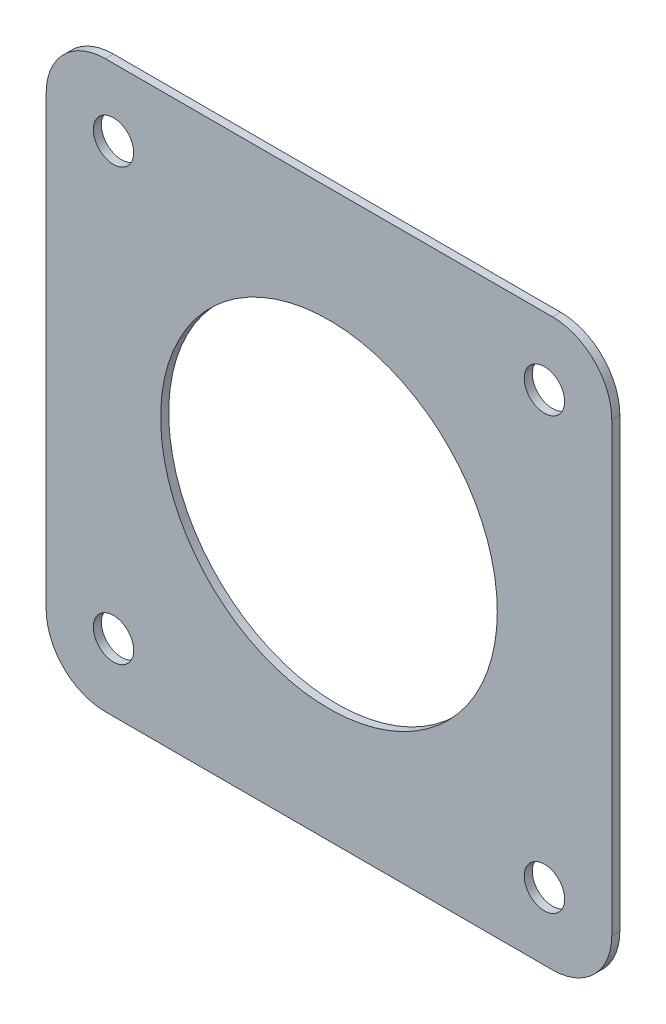
ISO-10303-21;
HEADER;
FILE_DESCRIPTION(('STEP AP214'),'2;1');
FILE_NAME('part.step','',(''),(''),'','','');
FILE_SCHEMA(('AUTOMOTIVE_DESIGN { 1 0 10303 214 1 1 1 1 }'));
ENDSEC;
DATA;
#1=APPLICATION_CONTEXT('core data for automotive mechanical design processes');
#2=APPLICATION_PROTOCOL_DEFINITION('international standard','automotive_design',2000,#1);
#3=PRODUCT_CONTEXT('',#1,'mechanical');
#4=PRODUCT('Part','Part','',(#3));
#5=PRODUCT_RELATED_PRODUCT_CATEGORY('part','',(#4));
#6=PRODUCT_DEFINITION_FORMATION('','',#4);
#7=PRODUCT_DEFINITION_CONTEXT('part definition',#1,'design');
#8=PRODUCT_DEFINITION('design','',#6,#7);
#9=PRODUCT_DEFINITION_SHAPE('','',#8);
#10=(LENGTH_UNIT() NAMED_UNIT(*) SI_UNIT(.MILLI.,.METRE.));
#11=(NAMED_UNIT(*) PLANE_ANGLE_UNIT() SI_UNIT($,.RADIAN.));
#12=(NAMED_UNIT(*) SI_UNIT($,.STERADIAN.) SOLID_ANGLE_UNIT());
#13=UNCERTAINTY_MEASURE_WITH_UNIT(LENGTH_MEASURE(1.E-05),#10,'distance_accuracy_value','');
#14=(GEOMETRIC_REPRESENTATION_CONTEXT(3) GLOBAL_UNCERTAINTY_ASSIGNED_CONTEXT((#13)) GLOBAL_UNIT_ASSIGNED_CONTEXT((#10,
#11,#12)) REPRESENTATION_CONTEXT('',''));
#15=CARTESIAN_POINT('',(0.,0.,0.));
#16=DIRECTION('',(0.,0.,1.));
#17=DIRECTION('',(1.,0.,0.));
#18=AXIS2_PLACEMENT_3D('',#15,#16,#17);
#19=CARTESIAN_POINT('',(-83.,-82.9999999999994,3.));
#20=DIRECTION('',(0.,0.,1.));
#21=DIRECTION('',(1.,0.,0.));
#22=AXIS2_PLACEMENT_3D('',#19,#20,#21);
#23=PLANE('',#22);
#24=CARTESIAN_POINT('',(-80.,-79.9999999999994,3.));
#25=DIRECTION('',(0.,0.,1.));
#26=DIRECTION('',(1.,0.,0.));
#27=AXIS2_PLACEMENT_3D('',#24,#25,#26);
#28=CIRCLE('',#27,7.5);
#29=CARTESIAN_POINT('',(-72.5,-79.9999999999994,3.));
#30=VERTEX_POINT('',#29);
#31=EDGE_CURVE('E194',#30,#30,#28,.T.);
#32=ORIENTED_EDGE('',*,*,#31,.F.);
#33=EDGE_LOOP('',(#32));
#34=FACE_BOUND('',#33,.T.);
#35=CARTESIAN_POINT('',(80.,80.,3.));
#36=DIRECTION('',(0.,0.,1.));
#37=DIRECTION('',(1.,0.,0.));
#38=AXIS2_PLACEMENT_3D('',#35,#36,#37);
#39=CIRCLE('',#38,7.5);
#40=CARTESIAN_POINT('',(87.5,80.,3.));
#41=VERTEX_POINT('',#40);
#42=EDGE_CURVE('E182',#41,#41,#39,.T.);
#43=ORIENTED_EDGE('',*,*,#42,.F.);
#44=EDGE_LOOP('',(#43));
#45=FACE_BOUND('',#44,.T.);
#46=CARTESIAN_POINT('',(-83.,-82.9999999999994,3.));
#47=DIRECTION('',(0.,0.,1.));
#48=DIRECTION('',(1.,0.,0.));
#49=AXIS2_PLACEMENT_3D('',#46,#47,#48);
#50=CIRCLE('',#49,22.);
#51=CARTESIAN_POINT('',(-105.,-82.9999999999994,3.));
#52=VERTEX_POINT('',#51);
#53=CARTESIAN_POINT('',(-82.9999999999999,-104.999999999999,3.));
#54=VERTEX_POINT('',#53);
#55=EDGE_CURVE('E145',#52,#54,#50,.T.);
#56=ORIENTED_EDGE('',*,*,#55,.T.);
#57=DIRECTION('',(1.,0.,0.));
#58=VECTOR('',#57,1.);
#59=CARTESIAN_POINT('',(-82.9999999999999,-104.999999999999,3.));
#60=LINE('',#59,#58);
#61=CARTESIAN_POINT('',(83.0000000000001,-105.,3.));
#62=VERTEX_POINT('',#61);
#63=EDGE_CURVE('E93',#54,#62,#60,.T.);
#64=ORIENTED_EDGE('',*,*,#63,.T.);
#65=CARTESIAN_POINT('',(83.,-83.,3.));
#66=DIRECTION('',(0.,0.,1.));
#67=DIRECTION('',(1.,0.,0.));
#68=AXIS2_PLACEMENT_3D('',#65,#66,#67);
#69=CIRCLE('',#68,22.);
#70=CARTESIAN_POINT('',(105.,-82.9999999999994,3.));
#71=VERTEX_POINT('',#70);
#72=EDGE_CURVE('E160',#62,#71,#69,.T.);
#73=ORIENTED_EDGE('',*,*,#72,.T.);
#74=DIRECTION('',(0.,1.,0.));
#75=VECTOR('',#74,1.);
#76=CARTESIAN_POINT('',(105.,-82.9999999999994,3.));
#77=LINE('',#76,#75);
#78=CARTESIAN_POINT('',(105.,83.0000000000006,3.));
#79=VERTEX_POINT('',#78);
#80=EDGE_CURVE('E173',#71,#79,#77,.T.);
#81=ORIENTED_EDGE('',*,*,#80,.T.);
#82=CARTESIAN_POINT('',(83.0000000000001,83.,3.));
#83=DIRECTION('',(0.,0.,1.));
#84=DIRECTION('',(1.,0.,0.));
#85=AXIS2_PLACEMENT_3D('',#82,#83,#84);
#86=CIRCLE('',#85,22.);
#87=CARTESIAN_POINT('',(83.,105.,3.));
#88=VERTEX_POINT('',#87);
#89=EDGE_CURVE('E112',#79,#88,#86,.T.);
#90=ORIENTED_EDGE('',*,*,#89,.T.);
#91=DIRECTION('',(-1.,0.,0.));
#92=VECTOR('',#91,1.);
#93=CARTESIAN_POINT('',(83.,105.,3.));
#94=LINE('',#93,#92);
#95=CARTESIAN_POINT('',(-83.,105.000000000001,3.));
#96=VERTEX_POINT('',#95);
#97=EDGE_CURVE('E106',#88,#96,#94,.T.);
#98=ORIENTED_EDGE('',*,*,#97,.T.);
#99=CARTESIAN_POINT('',(-82.9999999999999,83.0000000000006,3.));
#100=DIRECTION('',(0.,0.,1.));
#101=DIRECTION('',(1.,0.,0.));
#102=AXIS2_PLACEMENT_3D('',#99,#100,#101);
#103=CIRCLE('',#102,22.);
#104=CARTESIAN_POINT('',(-105.,83.0000000000006,3.));
#105=VERTEX_POINT('',#104);
#106=EDGE_CURVE('E110',#96,#105,#103,.T.);
#107=ORIENTED_EDGE('',*,*,#106,.T.);
#108=DIRECTION('',(0.,-1.,0.));
#109=VECTOR('',#108,1.);
#110=CARTESIAN_POINT('',(-105.,83.0000000000006,3.));
#111=LINE('',#110,#109);
#112=EDGE_CURVE('E50',#105,#52,#111,.T.);
#113=ORIENTED_EDGE('',*,*,#112,.T.);
#114=EDGE_LOOP('',(#56,#64,#73,#81,#90,#98,#107,#113));
#115=FACE_BOUND('',#114,.T.);
#116=CARTESIAN_POINT('',(-79.9999999999992,80.0000000000015,3.));
#117=DIRECTION('',(0.,0.,1.));
#118=DIRECTION('',(1.,0.,0.));
#119=AXIS2_PLACEMENT_3D('',#116,#117,#118);
#120=CIRCLE('',#119,7.5);
#121=CARTESIAN_POINT('',(-72.4999999999992,80.0000000000015,3.));
#122=VERTEX_POINT('',#121);
#123=EDGE_CURVE('E134',#122,#122,#120,.T.);
#124=ORIENTED_EDGE('',*,*,#123,.F.);
#125=EDGE_LOOP('',(#124));
#126=FACE_BOUND('',#125,.T.);
#127=CARTESIAN_POINT('',(79.9999999999997,-80.0000000000003,3.));
#128=DIRECTION('',(0.,0.,1.));
#129=DIRECTION('',(1.,0.,0.));
#130=AXIS2_PLACEMENT_3D('',#127,#128,#129);
#131=CIRCLE('',#130,7.5);
#132=CARTESIAN_POINT('',(87.4999999999997,-80.0000000000003,3.));
#133=VERTEX_POINT('',#132);
#134=EDGE_CURVE('E188',#133,#133,#131,.T.);
#135=ORIENTED_EDGE('',*,*,#134,.F.);
#136=EDGE_LOOP('',(#135));
#137=FACE_BOUND('',#136,.T.);
#138=CARTESIAN_POINT('',(0.,0.,3.));
#139=DIRECTION('',(0.,0.,1.));
#140=DIRECTION('',(1.,0.,0.));
#141=AXIS2_PLACEMENT_3D('',#138,#139,#140);
#142=CIRCLE('',#141,62.5);
#143=CARTESIAN_POINT('',(62.5,0.,3.));
#144=VERTEX_POINT('',#143);
#145=EDGE_CURVE('E200',#144,#144,#142,.T.);
#146=ORIENTED_EDGE('',*,*,#145,.F.);
#147=EDGE_LOOP('',(#146));
#148=FACE_BOUND('',#147,.T.);
#149=ADVANCED_FACE('F33',(#34,#45,#115,#126,#137,#148),#23,.T.);
#150=CARTESIAN_POINT('',(-83.,-82.9999999999994,0.));
#151=DIRECTION('',(0.,0.,1.));
#152=DIRECTION('',(1.,0.,0.));
#153=AXIS2_PLACEMENT_3D('',#150,#151,#152);
#154=PLANE('',#153);
#155=CARTESIAN_POINT('',(-80.,-79.9999999999994,0.));
#156=DIRECTION('',(0.,0.,1.));
#157=DIRECTION('',(1.,0.,0.));
#158=AXIS2_PLACEMENT_3D('',#155,#156,#157);
#159=CIRCLE('',#158,7.5);
#160=CARTESIAN_POINT('',(-72.5,-79.9999999999994,0.));
#161=VERTEX_POINT('',#160);
#162=EDGE_CURVE('E197',#161,#161,#159,.T.);
#163=ORIENTED_EDGE('',*,*,#162,.T.);
#164=EDGE_LOOP('',(#163));
#165=FACE_BOUND('',#164,.T.);
#166=CARTESIAN_POINT('',(80.,80.,0.));
#167=DIRECTION('',(0.,0.,1.));
#168=DIRECTION('',(1.,0.,0.));
#169=AXIS2_PLACEMENT_3D('',#166,#167,#168);
#170=CIRCLE('',#169,7.5);
#171=CARTESIAN_POINT('',(87.5,80.,0.));
#172=VERTEX_POINT('',#171);
#173=EDGE_CURVE('E185',#172,#172,#170,.T.);
#174=ORIENTED_EDGE('',*,*,#173,.T.);
#175=EDGE_LOOP('',(#174));
#176=FACE_BOUND('',#175,.T.);
#177=CARTESIAN_POINT('',(-83.,-82.9999999999994,0.));
#178=DIRECTION('',(0.,0.,1.));
#179=DIRECTION('',(1.,0.,0.));
#180=AXIS2_PLACEMENT_3D('',#177,#178,#179);
#181=CIRCLE('',#180,22.);
#182=CARTESIAN_POINT('',(-105.,-82.9999999999994,0.));
#183=VERTEX_POINT('',#182);
#184=CARTESIAN_POINT('',(-82.9999999999999,-104.999999999999,0.));
#185=VERTEX_POINT('',#184);
#186=EDGE_CURVE('E130',#183,#185,#181,.T.);
#187=ORIENTED_EDGE('',*,*,#186,.F.);
#188=DIRECTION('',(0.,-1.,0.));
#189=VECTOR('',#188,1.);
#190=CARTESIAN_POINT('',(-105.,83.0000000000006,0.));
#191=LINE('',#190,#189);
#192=CARTESIAN_POINT('',(-105.,83.0000000000006,0.));
#193=VERTEX_POINT('',#192);
#194=EDGE_CURVE('E85',#193,#183,#191,.T.);
#195=ORIENTED_EDGE('',*,*,#194,.F.);
#196=CARTESIAN_POINT('',(-82.9999999999999,83.0000000000006,0.));
#197=DIRECTION('',(0.,0.,1.));
#198=DIRECTION('',(1.,0.,0.));
#199=AXIS2_PLACEMENT_3D('',#196,#197,#198);
#200=CIRCLE('',#199,22.);
#201=CARTESIAN_POINT('',(-83.,105.000000000001,0.));
#202=VERTEX_POINT('',#201);
#203=EDGE_CURVE('E79',#202,#193,#200,.T.);
#204=ORIENTED_EDGE('',*,*,#203,.F.);
#205=DIRECTION('',(-1.,0.,0.));
#206=VECTOR('',#205,1.);
#207=CARTESIAN_POINT('',(83.,105.,0.));
#208=LINE('',#207,#206);
#209=CARTESIAN_POINT('',(83.,105.,0.));
#210=VERTEX_POINT('',#209);
#211=EDGE_CURVE('E120',#210,#202,#208,.T.);
#212=ORIENTED_EDGE('',*,*,#211,.F.);
#213=CARTESIAN_POINT('',(83.0000000000001,83.,0.));
#214=DIRECTION('',(0.,0.,1.));
#215=DIRECTION('',(1.,0.,0.));
#216=AXIS2_PLACEMENT_3D('',#213,#214,#215);
#217=CIRCLE('',#216,22.);
#218=CARTESIAN_POINT('',(105.,83.0000000000006,0.));
#219=VERTEX_POINT('',#218);
#220=EDGE_CURVE('E140',#219,#210,#217,.T.);
#221=ORIENTED_EDGE('',*,*,#220,.F.);
#222=DIRECTION('',(0.,1.,0.));
#223=VECTOR('',#222,1.);
#224=CARTESIAN_POINT('',(105.,-82.9999999999994,0.));
#225=LINE('',#224,#223);
#226=CARTESIAN_POINT('',(105.,-82.9999999999994,0.));
#227=VERTEX_POINT('',#226);
#228=EDGE_CURVE('E138',#227,#219,#225,.T.);
#229=ORIENTED_EDGE('',*,*,#228,.F.);
#230=CARTESIAN_POINT('',(83.,-83.,0.));
#231=DIRECTION('',(0.,0.,1.));
#232=DIRECTION('',(1.,0.,0.));
#233=AXIS2_PLACEMENT_3D('',#230,#231,#232);
#234=CIRCLE('',#233,22.);
#235=CARTESIAN_POINT('',(83.0000000000001,-105.,0.));
#236=VERTEX_POINT('',#235);
#237=EDGE_CURVE('E136',#236,#227,#234,.T.);
#238=ORIENTED_EDGE('',*,*,#237,.F.);
#239=DIRECTION('',(1.,0.,0.));
#240=VECTOR('',#239,1.);
#241=CARTESIAN_POINT('',(-82.9999999999999,-104.999999999999,0.));
#242=LINE('',#241,#240);
#243=EDGE_CURVE('E133',#185,#236,#242,.T.);
#244=ORIENTED_EDGE('',*,*,#243,.F.);
#245=EDGE_LOOP('',(#187,#195,#204,#212,#221,#229,#238,#244));
#246=FACE_BOUND('',#245,.T.);
#247=CARTESIAN_POINT('',(-79.9999999999992,80.0000000000015,0.));
#248=DIRECTION('',(0.,0.,1.));
#249=DIRECTION('',(1.,0.,0.));
#250=AXIS2_PLACEMENT_3D('',#247,#248,#249);
#251=CIRCLE('',#250,7.5);
#252=CARTESIAN_POINT('',(-72.4999999999992,80.0000000000015,0.));
#253=VERTEX_POINT('',#252);
#254=EDGE_CURVE('E179',#253,#253,#251,.T.);
#255=ORIENTED_EDGE('',*,*,#254,.T.);
#256=EDGE_LOOP('',(#255));
#257=FACE_BOUND('',#256,.T.);
#258=CARTESIAN_POINT('',(79.9999999999997,-80.0000000000003,0.));
#259=DIRECTION('',(0.,0.,1.));
#260=DIRECTION('',(1.,0.,0.));
#261=AXIS2_PLACEMENT_3D('',#258,#259,#260);
#262=CIRCLE('',#261,7.5);
#263=CARTESIAN_POINT('',(87.4999999999997,-80.0000000000003,0.));
#264=VERTEX_POINT('',#263);
#265=EDGE_CURVE('E191',#264,#264,#262,.T.);
#266=ORIENTED_EDGE('',*,*,#265,.T.);
#267=EDGE_LOOP('',(#266));
#268=FACE_BOUND('',#267,.T.);
#269=CARTESIAN_POINT('',(0.,0.,0.));
#270=DIRECTION('',(0.,0.,1.));
#271=DIRECTION('',(1.,0.,0.));
#272=AXIS2_PLACEMENT_3D('',#269,#270,#271);
#273=CIRCLE('',#272,62.5);
#274=CARTESIAN_POINT('',(62.5,0.,0.));
#275=VERTEX_POINT('',#274);
#276=EDGE_CURVE('E203',#275,#275,#273,.T.);
#277=ORIENTED_EDGE('',*,*,#276,.T.);
#278=EDGE_LOOP('',(#277));
#279=FACE_BOUND('',#278,.T.);
#280=ADVANCED_FACE('F164',(#165,#176,#246,#257,#268,#279),#154,.F.);
#281=CARTESIAN_POINT('',(-83.,-82.9999999999994,3.));
#282=DIRECTION('',(0.,0.,-1.));
#283=DIRECTION('',(-1.,0.,0.));
#284=AXIS2_PLACEMENT_3D('',#281,#282,#283);
#285=CYLINDRICAL_SURFACE('',#284,22.);
#286=ORIENTED_EDGE('',*,*,#186,.T.);
#287=DIRECTION('',(0.,0.,-1.));
#288=VECTOR('',#287,1.);
#289=CARTESIAN_POINT('',(-82.9999999999999,-104.999999999999,3.));
#290=LINE('',#289,#288);
#291=EDGE_CURVE('E11',#54,#185,#290,.T.);
#292=ORIENTED_EDGE('',*,*,#291,.F.);
#293=ORIENTED_EDGE('',*,*,#55,.F.);
#294=DIRECTION('',(0.,0.,-1.));
#295=VECTOR('',#294,1.);
#296=CARTESIAN_POINT('',(-105.,-82.9999999999994,3.));
#297=LINE('',#296,#295);
#298=EDGE_CURVE('E126',#52,#183,#297,.T.);
#299=ORIENTED_EDGE('',*,*,#298,.T.);
#300=EDGE_LOOP('',(#286,#292,#293,#299));
#301=FACE_BOUND('',#300,.T.);
#302=ADVANCED_FACE('F35',(#301),#285,.T.);
#303=CARTESIAN_POINT('',(-82.9999999999999,-104.999999999999,3.));
#304=DIRECTION('',(0.,1.,0.));
#305=DIRECTION('',(0.,0.,1.));
#306=AXIS2_PLACEMENT_3D('',#303,#304,#305);
#307=PLANE('',#306);
#308=ORIENTED_EDGE('',*,*,#243,.T.);
#309=DIRECTION('',(0.,0.,-1.));
#310=VECTOR('',#309,1.);
#311=CARTESIAN_POINT('',(83.0000000000001,-105.,3.));
#312=LINE('',#311,#310);
#313=EDGE_CURVE('E42',#62,#236,#312,.T.);
#314=ORIENTED_EDGE('',*,*,#313,.F.);
#315=ORIENTED_EDGE('',*,*,#63,.F.);
#316=ORIENTED_EDGE('',*,*,#291,.T.);
#317=EDGE_LOOP('',(#308,#314,#315,#316));
#318=FACE_BOUND('',#317,.T.);
#319=ADVANCED_FACE('F238',(#318),#307,.F.);
#320=CARTESIAN_POINT('',(83.,-83.,3.));
#321=DIRECTION('',(0.,0.,-1.));
#322=DIRECTION('',(-1.,0.,0.));
#323=AXIS2_PLACEMENT_3D('',#320,#321,#322);
#324=CYLINDRICAL_SURFACE('',#323,22.);
#325=ORIENTED_EDGE('',*,*,#237,.T.);
#326=DIRECTION('',(0.,0.,-1.));
#327=VECTOR('',#326,1.);
#328=CARTESIAN_POINT('',(105.,-82.9999999999994,3.));
#329=LINE('',#328,#327);
#330=EDGE_CURVE('E152',#71,#227,#329,.T.);
#331=ORIENTED_EDGE('',*,*,#330,.F.);
#332=ORIENTED_EDGE('',*,*,#72,.F.);
#333=ORIENTED_EDGE('',*,*,#313,.T.);
#334=EDGE_LOOP('',(#325,#331,#332,#333));
#335=FACE_BOUND('',#334,.T.);
#336=ADVANCED_FACE('F158',(#335),#324,.T.);
#337=CARTESIAN_POINT('',(105.,-82.9999999999994,3.));
#338=DIRECTION('',(-1.,0.,0.));
#339=DIRECTION('',(0.,0.,1.));
#340=AXIS2_PLACEMENT_3D('',#337,#338,#339);
#341=PLANE('',#340);
#342=ORIENTED_EDGE('',*,*,#228,.T.);
#343=DIRECTION('',(0.,0.,-1.));
#344=VECTOR('',#343,1.);
#345=CARTESIAN_POINT('',(105.,83.0000000000006,3.));
#346=LINE('',#345,#344);
#347=EDGE_CURVE('E149',#79,#219,#346,.T.);
#348=ORIENTED_EDGE('',*,*,#347,.F.);
#349=ORIENTED_EDGE('',*,*,#80,.F.);
#350=ORIENTED_EDGE('',*,*,#330,.T.);
#351=EDGE_LOOP('',(#342,#348,#349,#350));
#352=FACE_BOUND('',#351,.T.);
#353=ADVANCED_FACE('F169',(#352),#341,.F.);
#354=CARTESIAN_POINT('',(83.0000000000001,83.,3.));
#355=DIRECTION('',(0.,0.,-1.));
#356=DIRECTION('',(-1.,0.,0.));
#357=AXIS2_PLACEMENT_3D('',#354,#355,#356);
#358=CYLINDRICAL_SURFACE('',#357,22.);
#359=ORIENTED_EDGE('',*,*,#220,.T.);
#360=DIRECTION('',(0.,0.,-1.));
#361=VECTOR('',#360,1.);
#362=CARTESIAN_POINT('',(83.,105.,3.));
#363=LINE('',#362,#361);
#364=EDGE_CURVE('E121',#88,#210,#363,.T.);
#365=ORIENTED_EDGE('',*,*,#364,.F.);
#366=ORIENTED_EDGE('',*,*,#89,.F.);
#367=ORIENTED_EDGE('',*,*,#347,.T.);
#368=EDGE_LOOP('',(#359,#365,#366,#367));
#369=FACE_BOUND('',#368,.T.);
#370=ADVANCED_FACE('F172',(#369),#358,.T.);
#371=CARTESIAN_POINT('',(83.,105.,3.));
#372=DIRECTION('',(0.,-1.,0.));
#373=DIRECTION('',(0.,0.,-1.));
#374=AXIS2_PLACEMENT_3D('',#371,#372,#373);
#375=PLANE('',#374);
#376=ORIENTED_EDGE('',*,*,#211,.T.);
#377=DIRECTION('',(0.,0.,-1.));
#378=VECTOR('',#377,1.);
#379=CARTESIAN_POINT('',(-83.,105.000000000001,3.));
#380=LINE('',#379,#378);
#381=EDGE_CURVE('E117',#96,#202,#380,.T.);
#382=ORIENTED_EDGE('',*,*,#381,.F.);
#383=ORIENTED_EDGE('',*,*,#97,.F.);
#384=ORIENTED_EDGE('',*,*,#364,.T.);
#385=EDGE_LOOP('',(#376,#382,#383,#384));
#386=FACE_BOUND('',#385,.T.);
#387=ADVANCED_FACE('F118',(#386),#375,.F.);
#388=CARTESIAN_POINT('',(-82.9999999999999,83.0000000000006,3.));
#389=DIRECTION('',(0.,0.,-1.));
#390=DIRECTION('',(-1.,0.,0.));
#391=AXIS2_PLACEMENT_3D('',#388,#389,#390);
#392=CYLINDRICAL_SURFACE('',#391,22.);
#393=ORIENTED_EDGE('',*,*,#203,.T.);
#394=DIRECTION('',(0.,0.,-1.));
#395=VECTOR('',#394,1.);
#396=CARTESIAN_POINT('',(-105.,83.0000000000006,3.));
#397=LINE('',#396,#395);
#398=EDGE_CURVE('E122',#105,#193,#397,.T.);
#399=ORIENTED_EDGE('',*,*,#398,.F.);
#400=ORIENTED_EDGE('',*,*,#106,.F.);
#401=ORIENTED_EDGE('',*,*,#381,.T.);
#402=EDGE_LOOP('',(#393,#399,#400,#401));
#403=FACE_BOUND('',#402,.T.);
#404=ADVANCED_FACE('F124',(#403),#392,.T.);
#405=CARTESIAN_POINT('',(-105.,83.0000000000006,3.));
#406=DIRECTION('',(1.,0.,0.));
#407=DIRECTION('',(0.,1.,0.));
#408=AXIS2_PLACEMENT_3D('',#405,#406,#407);
#409=PLANE('',#408);
#410=ORIENTED_EDGE('',*,*,#194,.T.);
#411=ORIENTED_EDGE('',*,*,#298,.F.);
#412=ORIENTED_EDGE('',*,*,#112,.F.);
#413=ORIENTED_EDGE('',*,*,#398,.T.);
#414=EDGE_LOOP('',(#410,#411,#412,#413));
#415=FACE_BOUND('',#414,.T.);
#416=ADVANCED_FACE('F226',(#415),#409,.F.);
#417=CARTESIAN_POINT('',(-79.9999999999992,80.0000000000015,3.));
#418=DIRECTION('',(0.,0.,-1.));
#419=DIRECTION('',(-1.,0.,0.));
#420=AXIS2_PLACEMENT_3D('',#417,#418,#419);
#421=CYLINDRICAL_SURFACE('',#420,7.5);
#422=ORIENTED_EDGE('',*,*,#123,.T.);
#423=EDGE_LOOP('',(#422));
#424=FACE_BOUND('',#423,.T.);
#425=ORIENTED_EDGE('',*,*,#254,.F.);
#426=EDGE_LOOP('',(#425));
#427=FACE_BOUND('',#426,.T.);
#428=ADVANCED_FACE('F223',(#424,#427),#421,.F.);
#429=CARTESIAN_POINT('',(80.,80.,3.));
#430=DIRECTION('',(0.,0.,-1.));
#431=DIRECTION('',(-1.,0.,0.));
#432=AXIS2_PLACEMENT_3D('',#429,#430,#431);
#433=CYLINDRICAL_SURFACE('',#432,7.5);
#434=ORIENTED_EDGE('',*,*,#42,.T.);
#435=EDGE_LOOP('',(#434));
#436=FACE_BOUND('',#435,.T.);
#437=ORIENTED_EDGE('',*,*,#173,.F.);
#438=EDGE_LOOP('',(#437));
#439=FACE_BOUND('',#438,.T.);
#440=ADVANCED_FACE('F287',(#436,#439),#433,.F.);
#441=CARTESIAN_POINT('',(79.9999999999997,-80.0000000000003,3.));
#442=DIRECTION('',(0.,0.,-1.));
#443=DIRECTION('',(-1.,0.,0.));
#444=AXIS2_PLACEMENT_3D('',#441,#442,#443);
#445=CYLINDRICAL_SURFACE('',#444,7.5);
#446=ORIENTED_EDGE('',*,*,#134,.T.);
#447=EDGE_LOOP('',(#446));
#448=FACE_BOUND('',#447,.T.);
#449=ORIENTED_EDGE('',*,*,#265,.F.);
#450=EDGE_LOOP('',(#449));
#451=FACE_BOUND('',#450,.T.);
#452=ADVANCED_FACE('F294',(#448,#451),#445,.F.);
#453=CARTESIAN_POINT('',(-80.,-79.9999999999994,3.));
#454=DIRECTION('',(0.,0.,-1.));
#455=DIRECTION('',(-1.,0.,0.));
#456=AXIS2_PLACEMENT_3D('',#453,#454,#455);
#457=CYLINDRICAL_SURFACE('',#456,7.5);
#458=ORIENTED_EDGE('',*,*,#31,.T.);
#459=EDGE_LOOP('',(#458));
#460=FACE_BOUND('',#459,.T.);
#461=ORIENTED_EDGE('',*,*,#162,.F.);
#462=EDGE_LOOP('',(#461));
#463=FACE_BOUND('',#462,.T.);
#464=ADVANCED_FACE('F301',(#460,#463),#457,.F.);
#465=CARTESIAN_POINT('',(0.,0.,3.));
#466=DIRECTION('',(0.,0.,-1.));
#467=DIRECTION('',(-1.,0.,0.));
#468=AXIS2_PLACEMENT_3D('',#465,#466,#467);
#469=CYLINDRICAL_SURFACE('',#468,62.5);
#470=ORIENTED_EDGE('',*,*,#145,.T.);
#471=EDGE_LOOP('',(#470));
#472=FACE_BOUND('',#471,.T.);
#473=ORIENTED_EDGE('',*,*,#276,.F.);
#474=EDGE_LOOP('',(#473));
#475=FACE_BOUND('',#474,.T.);
#476=ADVANCED_FACE('F209',(#472,#475),#469,.F.);
#477=CLOSED_SHELL('',(#149,#280,#302,#319,#336,#353,#370,#387,#404,#416,#428,#440,#452,#464,#476));
#478=MANIFOLD_SOLID_BREP('B2',#477);
#479=ADVANCED_BREP_SHAPE_REPRESENTATION('',(#18,#478),#14);
#480=SHAPE_DEFINITION_REPRESENTATION(#9,#479);
ENDSEC;
END-ISO-10303-21;
